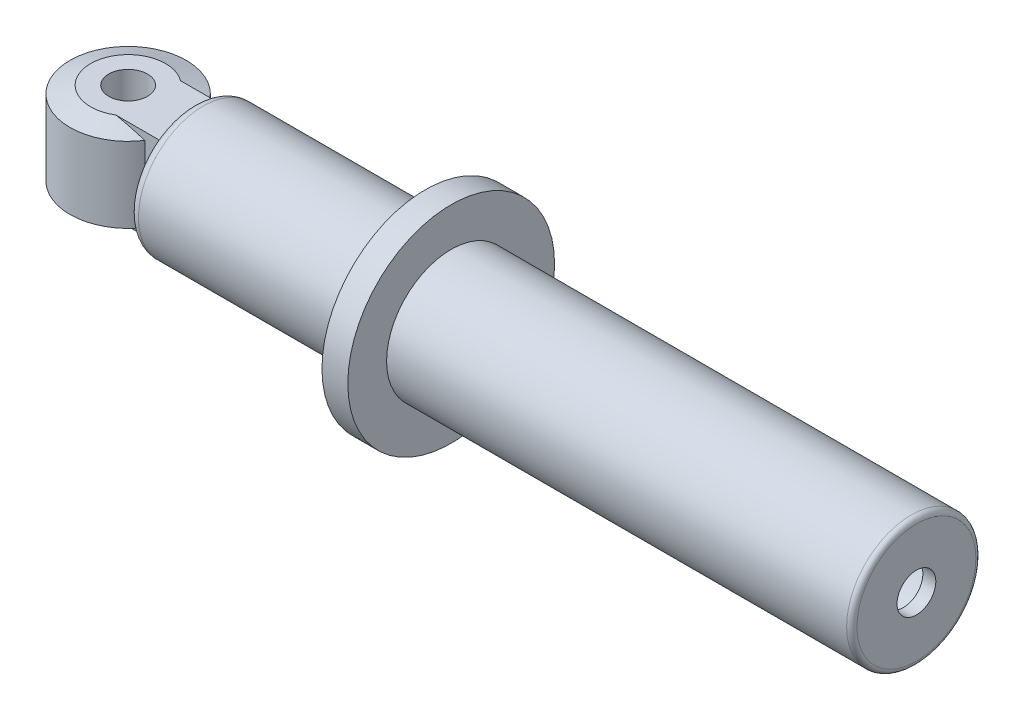
ISO-10303-21;
HEADER;
FILE_DESCRIPTION(('STEP AP214'),'2;1');
FILE_NAME('part.step','',(''),(''),'','','');
FILE_SCHEMA(('AUTOMOTIVE_DESIGN { 1 0 10303 214 1 1 1 1 }'));
ENDSEC;
DATA;
#1=APPLICATION_CONTEXT('core data for automotive mechanical design processes');
#2=APPLICATION_PROTOCOL_DEFINITION('international standard','automotive_design',2000,#1);
#3=PRODUCT_CONTEXT('',#1,'mechanical');
#4=PRODUCT('Part','Part','',(#3));
#5=PRODUCT_RELATED_PRODUCT_CATEGORY('part','',(#4));
#6=PRODUCT_DEFINITION_FORMATION('','',#4);
#7=PRODUCT_DEFINITION_CONTEXT('part definition',#1,'design');
#8=PRODUCT_DEFINITION('design','',#6,#7);
#9=PRODUCT_DEFINITION_SHAPE('','',#8);
#10=(LENGTH_UNIT() NAMED_UNIT(*) SI_UNIT(.MILLI.,.METRE.));
#11=(NAMED_UNIT(*) PLANE_ANGLE_UNIT() SI_UNIT($,.RADIAN.));
#12=(NAMED_UNIT(*) SI_UNIT($,.STERADIAN.) SOLID_ANGLE_UNIT());
#13=UNCERTAINTY_MEASURE_WITH_UNIT(LENGTH_MEASURE(1.E-05),#10,'distance_accuracy_value','');
#14=(GEOMETRIC_REPRESENTATION_CONTEXT(3) GLOBAL_UNCERTAINTY_ASSIGNED_CONTEXT((#13)) GLOBAL_UNIT_ASSIGNED_CONTEXT((#10,
#11,#12)) REPRESENTATION_CONTEXT('',''));
#15=CARTESIAN_POINT('',(0.,0.,0.));
#16=DIRECTION('',(0.,0.,1.));
#17=DIRECTION('',(1.,0.,0.));
#18=AXIS2_PLACEMENT_3D('',#15,#16,#17);
#19=CARTESIAN_POINT('',(-96.1974013589838,0.,-6.88881737924014));
#20=DIRECTION('',(-1.,0.,0.));
#21=DIRECTION('',(0.,0.,1.));
#22=AXIS2_PLACEMENT_3D('',#19,#20,#21);
#23=PLANE('',#22);
#24=DIRECTION('',(0.,-1.,0.));
#25=VECTOR('',#24,1.);
#26=CARTESIAN_POINT('',(-96.1974013589838,11.1125,-9.69286101077848));
#27=LINE('',#26,#25);
#28=CARTESIAN_POINT('',(-96.1974013589838,11.0975940785161,-9.69286101077848));
#29=VERTEX_POINT('',#28);
#30=CARTESIAN_POINT('',(-96.1974013589838,-11.0975940785161,-9.69286101077848));
#31=VERTEX_POINT('',#30);
#32=EDGE_CURVE('E249',#29,#31,#27,.T.);
#33=ORIENTED_EDGE('',*,*,#32,.F.);
#34=CARTESIAN_POINT('',(-96.1974013589838,0.,-2.29924006644521));
#35=DIRECTION('',(-1.,0.,0.));
#36=DIRECTION('',(0.,0.,1.));
#37=AXIS2_PLACEMENT_3D('',#34,#35,#36);
#38=CIRCLE('',#37,13.335);
#39=EDGE_CURVE('E140',#29,#31,#38,.T.);
#40=ORIENTED_EDGE('',*,*,#39,.T.);
#41=EDGE_LOOP('',(#33,#40));
#42=FACE_BOUND('',#41,.T.);
#43=ADVANCED_FACE('F34',(#42),#23,.T.);
#44=DIRECTION('',(0.,0.,-1.));
#45=VECTOR('',#44,1.);
#46=CARTESIAN_POINT('',(-96.1974013589838,-11.1125,-9.69286101077848));
#47=LINE('',#46,#45);
#48=CARTESIAN_POINT('',(-96.1974013589838,-11.1125,5.07195853011967));
#49=VERTEX_POINT('',#48);
#50=CARTESIAN_POINT('',(-96.1974013589838,-11.1125,-9.67043866301009));
#51=VERTEX_POINT('',#50);
#52=EDGE_CURVE('E257',#49,#51,#47,.T.);
#53=ORIENTED_EDGE('',*,*,#52,.T.);
#54=CARTESIAN_POINT('',(-96.1974013589838,0.,-2.29924006644521));
#55=DIRECTION('',(-1.,0.,0.));
#56=DIRECTION('',(0.,0.,1.));
#57=AXIS2_PLACEMENT_3D('',#54,#55,#56);
#58=CIRCLE('',#57,13.335);
#59=EDGE_CURVE('E132',#51,#49,#58,.T.);
#60=ORIENTED_EDGE('',*,*,#59,.T.);
#61=EDGE_LOOP('',(#53,#60));
#62=FACE_BOUND('',#61,.T.);
#63=ADVANCED_FACE('F225',(#62),#23,.T.);
#64=DIRECTION('',(0.,-1.,0.));
#65=VECTOR('',#64,1.);
#66=CARTESIAN_POINT('',(-96.1974013589838,11.1125,5.54713898922151));
#67=LINE('',#66,#65);
#68=CARTESIAN_POINT('',(-96.1974013589838,10.7822335679948,5.54713898922151));
#69=VERTEX_POINT('',#68);
#70=CARTESIAN_POINT('',(-96.1974013589838,-10.7822335679948,5.54713898922151));
#71=VERTEX_POINT('',#70);
#72=EDGE_CURVE('E246',#69,#71,#67,.T.);
#73=ORIENTED_EDGE('',*,*,#72,.T.);
#74=CARTESIAN_POINT('',(-96.1974013589838,0.,-2.29924006644521));
#75=DIRECTION('',(-1.,0.,0.));
#76=DIRECTION('',(0.,0.,1.));
#77=AXIS2_PLACEMENT_3D('',#74,#75,#76);
#78=CIRCLE('',#77,13.335);
#79=EDGE_CURVE('E129',#71,#69,#78,.T.);
#80=ORIENTED_EDGE('',*,*,#79,.T.);
#81=EDGE_LOOP('',(#73,#80));
#82=FACE_BOUND('',#81,.T.);
#83=ADVANCED_FACE('F230',(#82),#23,.T.);
#84=DIRECTION('',(0.,0.,-1.));
#85=VECTOR('',#84,1.);
#86=CARTESIAN_POINT('',(-96.1974013589838,11.1125,-9.69286101077848));
#87=LINE('',#86,#85);
#88=CARTESIAN_POINT('',(-96.1974013589838,11.1125,5.07195853011967));
#89=VERTEX_POINT('',#88);
#90=CARTESIAN_POINT('',(-96.1974013589838,11.1125,-9.67043866301009));
#91=VERTEX_POINT('',#90);
#92=EDGE_CURVE('E115',#89,#91,#87,.T.);
#93=ORIENTED_EDGE('',*,*,#92,.F.);
#94=CARTESIAN_POINT('',(-96.1974013589838,0.,-2.29924006644521));
#95=DIRECTION('',(-1.,0.,0.));
#96=DIRECTION('',(0.,0.,1.));
#97=AXIS2_PLACEMENT_3D('',#94,#95,#96);
#98=CIRCLE('',#97,13.335);
#99=EDGE_CURVE('E125',#89,#91,#98,.T.);
#100=ORIENTED_EDGE('',*,*,#99,.T.);
#101=EDGE_LOOP('',(#93,#100));
#102=FACE_BOUND('',#101,.T.);
#103=ADVANCED_FACE('F124',(#102),#23,.T.);
#104=CARTESIAN_POINT('',(2.22759864101624,0.,-6.88881737924014));
#105=DIRECTION('',(1.,0.,0.));
#106=DIRECTION('',(0.,0.,-1.));
#107=AXIS2_PLACEMENT_3D('',#104,#105,#106);
#108=PLANE('',#107);
#109=CARTESIAN_POINT('',(2.22759864101624,0.,-2.29924006644521));
#110=DIRECTION('',(-1.,0.,0.));
#111=DIRECTION('',(0.,0.,1.));
#112=AXIS2_PLACEMENT_3D('',#109,#110,#111);
#113=CIRCLE('',#112,12.7);
#114=CARTESIAN_POINT('',(2.22759864101624,0.,10.4007599335548));
#115=VERTEX_POINT('',#114);
#116=EDGE_CURVE('E130',#115,#115,#113,.T.);
#117=ORIENTED_EDGE('',*,*,#116,.F.);
#118=EDGE_LOOP('',(#117));
#119=FACE_BOUND('',#118,.T.);
#120=ADVANCED_FACE('F234',(#119),#108,.T.);
#121=CARTESIAN_POINT('',(-96.1974013589838,0.,-2.29924006644521));
#122=DIRECTION('',(-1.,0.,0.));
#123=DIRECTION('',(0.,0.,1.));
#124=AXIS2_PLACEMENT_3D('',#121,#122,#123);
#125=CYLINDRICAL_SURFACE('',#124,12.7);
#126=ORIENTED_EDGE('',*,*,#116,.T.);
#127=EDGE_LOOP('',(#126));
#128=FACE_BOUND('',#127,.T.);
#129=CARTESIAN_POINT('',(78.4275986410162,0.,-2.29924006644521));
#130=DIRECTION('',(-1.,0.,0.));
#131=DIRECTION('',(0.,0.,1.));
#132=AXIS2_PLACEMENT_3D('',#129,#130,#131);
#133=CIRCLE('',#132,12.7);
#134=CARTESIAN_POINT('',(78.4275986410162,0.,10.4007599335548));
#135=VERTEX_POINT('',#134);
#136=EDGE_CURVE('E135',#135,#135,#133,.T.);
#137=ORIENTED_EDGE('',*,*,#136,.F.);
#138=EDGE_LOOP('',(#137));
#139=FACE_BOUND('',#138,.T.);
#140=ADVANCED_FACE('F239',(#128,#139),#125,.F.);
#141=CARTESIAN_POINT('',(78.4275986410162,0.,-6.88881737924014));
#142=DIRECTION('',(-1.,0.,0.));
#143=DIRECTION('',(0.,0.,1.));
#144=AXIS2_PLACEMENT_3D('',#141,#142,#143);
#145=PLANE('',#144);
#146=ORIENTED_EDGE('',*,*,#136,.T.);
#147=EDGE_LOOP('',(#146));
#148=FACE_BOUND('',#147,.T.);
#149=CARTESIAN_POINT('',(78.4275986410163,0.,-2.29924006644521));
#150=DIRECTION('',(-1.,0.,0.));
#151=DIRECTION('',(0.,0.,1.));
#152=AXIS2_PLACEMENT_3D('',#149,#150,#151);
#153=CIRCLE('',#152,4.7625);
#154=CARTESIAN_POINT('',(78.4275986410163,0.,2.46325993355479));
#155=VERTEX_POINT('',#154);
#156=EDGE_CURVE('E290',#155,#155,#153,.T.);
#157=ORIENTED_EDGE('',*,*,#156,.F.);
#158=EDGE_LOOP('',(#157));
#159=FACE_BOUND('',#158,.T.);
#160=ADVANCED_FACE('F295',(#148,#159),#145,.T.);
#161=CARTESIAN_POINT('',(-96.1974013589838,0.,-2.29924006644521));
#162=DIRECTION('',(-1.,0.,0.));
#163=DIRECTION('',(0.,0.,1.));
#164=AXIS2_PLACEMENT_3D('',#161,#162,#163);
#165=CYLINDRICAL_SURFACE('',#164,4.7625);
#166=ORIENTED_EDGE('',*,*,#156,.T.);
#167=EDGE_LOOP('',(#166));
#168=FACE_BOUND('',#167,.T.);
#169=CARTESIAN_POINT('',(81.6025986410162,0.,-2.29924006644521));
#170=DIRECTION('',(-1.,0.,0.));
#171=DIRECTION('',(0.,0.,1.));
#172=AXIS2_PLACEMENT_3D('',#169,#170,#171);
#173=CIRCLE('',#172,4.7625);
#174=CARTESIAN_POINT('',(81.6025986410162,0.,2.46325993355479));
#175=VERTEX_POINT('',#174);
#176=EDGE_CURVE('E287',#175,#175,#173,.T.);
#177=ORIENTED_EDGE('',*,*,#176,.F.);
#178=EDGE_LOOP('',(#177));
#179=FACE_BOUND('',#178,.T.);
#180=ADVANCED_FACE('F304',(#168,#179),#165,.F.);
#181=CARTESIAN_POINT('',(81.6025986410162,0.,-6.88881737924014));
#182=DIRECTION('',(1.,0.,0.));
#183=DIRECTION('',(0.,0.,-1.));
#184=AXIS2_PLACEMENT_3D('',#181,#182,#183);
#185=PLANE('',#184);
#186=CARTESIAN_POINT('',(81.6025986410162,0.,-2.29924006644521));
#187=DIRECTION('',(1.,0.,0.));
#188=DIRECTION('',(0.,0.,-1.));
#189=AXIS2_PLACEMENT_3D('',#186,#187,#188);
#190=CIRCLE('',#189,14.605);
#191=CARTESIAN_POINT('',(81.6025986410162,0.,-16.9042400664452));
#192=VERTEX_POINT('',#191);
#193=EDGE_CURVE('E11',#192,#192,#190,.T.);
#194=ORIENTED_EDGE('',*,*,#193,.T.);
#195=EDGE_LOOP('',(#194));
#196=FACE_BOUND('',#195,.T.);
#197=ORIENTED_EDGE('',*,*,#176,.T.);
#198=EDGE_LOOP('',(#197));
#199=FACE_BOUND('',#198,.T.);
#200=ADVANCED_FACE('F309',(#196,#199),#185,.T.);
#201=CARTESIAN_POINT('',(-96.1974013589838,0.,-2.29924006644521));
#202=DIRECTION('',(-1.,0.,0.));
#203=DIRECTION('',(0.,0.,1.));
#204=AXIS2_PLACEMENT_3D('',#201,#202,#203);
#205=CYLINDRICAL_SURFACE('',#204,15.875);
#206=CARTESIAN_POINT('',(80.3325986410162,0.,-2.29924006644521));
#207=DIRECTION('',(1.,0.,0.));
#208=DIRECTION('',(0.,0.,-1.));
#209=AXIS2_PLACEMENT_3D('',#206,#207,#208);
#210=CIRCLE('',#209,15.875);
#211=CARTESIAN_POINT('',(80.3325986410162,0.,-18.1742400664452));
#212=VERTEX_POINT('',#211);
#213=EDGE_CURVE('E42',#212,#212,#210,.F.);
#214=ORIENTED_EDGE('',*,*,#213,.T.);
#215=EDGE_LOOP('',(#214));
#216=FACE_BOUND('',#215,.T.);
#217=CARTESIAN_POINT('',(-32.6974013589837,0.,-2.29924006644521));
#218=DIRECTION('',(-1.,0.,0.));
#219=DIRECTION('',(0.,0.,1.));
#220=AXIS2_PLACEMENT_3D('',#217,#218,#219);
#221=CIRCLE('',#220,15.875);
#222=CARTESIAN_POINT('',(-32.6974013589837,0.,13.5757599335548));
#223=VERTEX_POINT('',#222);
#224=EDGE_CURVE('E284',#223,#223,#221,.T.);
#225=ORIENTED_EDGE('',*,*,#224,.F.);
#226=EDGE_LOOP('',(#225));
#227=FACE_BOUND('',#226,.T.);
#228=ADVANCED_FACE('F313',(#216,#227),#205,.T.);
#229=CARTESIAN_POINT('',(-32.6974013589837,0.,-6.88881737924005));
#230=DIRECTION('',(1.,0.,0.));
#231=DIRECTION('',(0.,0.,-1.));
#232=AXIS2_PLACEMENT_3D('',#229,#230,#231);
#233=PLANE('',#232);
#234=ORIENTED_EDGE('',*,*,#224,.T.);
#235=EDGE_LOOP('',(#234));
#236=FACE_BOUND('',#235,.T.);
#237=CARTESIAN_POINT('',(-32.6974013589837,0.,-2.29924006644521));
#238=DIRECTION('',(-1.,0.,0.));
#239=DIRECTION('',(0.,0.,1.));
#240=AXIS2_PLACEMENT_3D('',#237,#238,#239);
#241=CIRCLE('',#240,25.4);
#242=CARTESIAN_POINT('',(-32.6974013589837,0.,23.1007599335548));
#243=VERTEX_POINT('',#242);
#244=EDGE_CURVE('E281',#243,#243,#241,.T.);
#245=ORIENTED_EDGE('',*,*,#244,.F.);
#246=EDGE_LOOP('',(#245));
#247=FACE_BOUND('',#246,.T.);
#248=ADVANCED_FACE('F317',(#236,#247),#233,.T.);
#249=CARTESIAN_POINT('',(-96.1974013589838,0.,-2.29924006644521));
#250=DIRECTION('',(-1.,0.,0.));
#251=DIRECTION('',(0.,0.,1.));
#252=AXIS2_PLACEMENT_3D('',#249,#250,#251);
#253=CYLINDRICAL_SURFACE('',#252,25.4);
#254=ORIENTED_EDGE('',*,*,#244,.T.);
#255=EDGE_LOOP('',(#254));
#256=FACE_BOUND('',#255,.T.);
#257=CARTESIAN_POINT('',(-39.0474013589837,0.,-2.29924006644521));
#258=DIRECTION('',(-1.,0.,0.));
#259=DIRECTION('',(0.,0.,1.));
#260=AXIS2_PLACEMENT_3D('',#257,#258,#259);
#261=CIRCLE('',#260,25.4);
#262=CARTESIAN_POINT('',(-39.0474013589837,0.,23.1007599335548));
#263=VERTEX_POINT('',#262);
#264=EDGE_CURVE('E278',#263,#263,#261,.T.);
#265=ORIENTED_EDGE('',*,*,#264,.F.);
#266=EDGE_LOOP('',(#265));
#267=FACE_BOUND('',#266,.T.);
#268=ADVANCED_FACE('F321',(#256,#267),#253,.T.);
#269=CARTESIAN_POINT('',(-39.0474013589837,0.,-6.88881737924014));
#270=DIRECTION('',(-1.,0.,0.));
#271=DIRECTION('',(0.,0.,1.));
#272=AXIS2_PLACEMENT_3D('',#269,#270,#271);
#273=PLANE('',#272);
#274=ORIENTED_EDGE('',*,*,#264,.T.);
#275=EDGE_LOOP('',(#274));
#276=FACE_BOUND('',#275,.T.);
#277=CARTESIAN_POINT('',(-39.0474013589837,0.,-2.29924006644521));
#278=DIRECTION('',(-1.,0.,0.));
#279=DIRECTION('',(0.,0.,1.));
#280=AXIS2_PLACEMENT_3D('',#277,#278,#279);
#281=CIRCLE('',#280,15.875);
#282=CARTESIAN_POINT('',(-39.0474013589837,0.,13.5757599335548));
#283=VERTEX_POINT('',#282);
#284=EDGE_CURVE('E275',#283,#283,#281,.T.);
#285=ORIENTED_EDGE('',*,*,#284,.F.);
#286=EDGE_LOOP('',(#285));
#287=FACE_BOUND('',#286,.T.);
#288=ADVANCED_FACE('F325',(#276,#287),#273,.T.);
#289=CARTESIAN_POINT('',(-96.1974013589838,0.,-2.29924006644521));
#290=DIRECTION('',(-1.,0.,0.));
#291=DIRECTION('',(0.,0.,1.));
#292=AXIS2_PLACEMENT_3D('',#289,#290,#291);
#293=CYLINDRICAL_SURFACE('',#292,15.875);
#294=CARTESIAN_POINT('',(-93.6574013589837,0.,-2.29924006644521));
#295=DIRECTION('',(-1.,0.,0.));
#296=DIRECTION('',(0.,0.,1.));
#297=AXIS2_PLACEMENT_3D('',#294,#295,#296);
#298=CIRCLE('',#297,15.875);
#299=CARTESIAN_POINT('',(-93.6574013589837,0.,13.5757599335548));
#300=VERTEX_POINT('',#299);
#301=EDGE_CURVE('E143',#300,#300,#298,.F.);
#302=ORIENTED_EDGE('',*,*,#301,.T.);
#303=EDGE_LOOP('',(#302));
#304=FACE_BOUND('',#303,.T.);
#305=ORIENTED_EDGE('',*,*,#284,.T.);
#306=EDGE_LOOP('',(#305));
#307=FACE_BOUND('',#306,.T.);
#308=ADVANCED_FACE('F210',(#304,#307),#293,.T.);
#309=CARTESIAN_POINT('',(-112.072401358984,11.1125,-2.29924006644521));
#310=DIRECTION('',(0.,1.,0.));
#311=DIRECTION('',(0.,0.,1.));
#312=AXIS2_PLACEMENT_3D('',#309,#310,#311);
#313=PLANE('',#312);
#314=CARTESIAN_POINT('',(-112.072401358984,11.1125,-2.29924006644521));
#315=DIRECTION('',(0.,1.,0.));
#316=DIRECTION('',(0.,0.,1.));
#317=AXIS2_PLACEMENT_3D('',#314,#315,#316);
#318=CIRCLE('',#317,9.2075);
#319=CARTESIAN_POINT('',(-106.584922376653,11.1125,-9.69286101077848));
#320=VERTEX_POINT('',#319);
#321=CARTESIAN_POINT('',(-107.254477328367,11.1125,5.54713898922152));
#322=VERTEX_POINT('',#321);
#323=EDGE_CURVE('E347',#320,#322,#318,.T.);
#324=ORIENTED_EDGE('',*,*,#323,.T.);
#325=DIRECTION('',(1.,0.,0.));
#326=VECTOR('',#325,1.);
#327=CARTESIAN_POINT('',(-96.1974013589838,11.1125,5.54713898922151));
#328=LINE('',#327,#326);
#329=CARTESIAN_POINT('',(-96.1831774937806,11.1125,5.54713898922151));
#330=VERTEX_POINT('',#329);
#331=EDGE_CURVE('E49',#322,#330,#328,.T.);
#332=ORIENTED_EDGE('',*,*,#331,.T.);
#333=CARTESIAN_POINT('',(-96.1831774937806,11.1125,5.54713898922151));
#334=CARTESIAN_POINT('',(-96.1856019810082,11.1125,5.50758580299217));
#335=CARTESIAN_POINT('',(-96.1877030547722,11.1125,5.46801314510971));
#336=CARTESIAN_POINT('',(-96.1912784948805,11.1125,5.38884875387605));
#337=CARTESIAN_POINT('',(-96.1927530078009,11.1125,5.34925702715785));
#338=CARTESIAN_POINT('',(-96.1950965455518,11.1125,5.27005637735863));
#339=CARTESIAN_POINT('',(-96.195965578598,11.1125,5.23044745451824));
#340=CARTESIAN_POINT('',(-96.1971180096283,11.1125,5.15121176611561));
#341=CARTESIAN_POINT('',(-96.1974012704591,11.1125,5.11158499854708));
#342=CARTESIAN_POINT('',(-96.1974013589838,11.1125,5.07195853011967));
#343=B_SPLINE_CURVE_WITH_KNOTS('',3,(#333,#334,#335,#336,#337,#338,#339,#340,#341,#342),
.UNSPECIFIED.,.F.,.F.,(4,2,2,2,4),(0.,0.118880439180969,0.237733052441402,0.356584052989242,
0.475462878317814),.UNSPECIFIED.);
#344=EDGE_CURVE('E111',#330,#89,#343,.T.);
#345=ORIENTED_EDGE('',*,*,#344,.T.);
#346=ORIENTED_EDGE('',*,*,#92,.T.);
#347=CARTESIAN_POINT('',(-96.1974013589838,11.1125,-9.67043866301009));
#348=CARTESIAN_POINT('',(-96.1974013643173,11.1125,-9.67417572780315));
#349=CARTESIAN_POINT('',(-96.197398841608,11.1125,-9.67791278917947));
#350=CARTESIAN_POINT('',(-96.1973887401037,11.1125,-9.68538690510228));
#351=CARTESIAN_POINT('',(-96.1973811613087,11.1125,-9.68912395964874));
#352=CARTESIAN_POINT('',(-96.1973710544708,11.1125,-9.69286101077848));
#353=B_SPLINE_CURVE_WITH_KNOTS('',3,(#347,#348,#349,#350,#351,#352),.UNSPECIFIED.,.F.,.F.,(4,2,
4),(0.,0.0112111866834286,0.0224223733776529),.UNSPECIFIED.);
#354=CARTESIAN_POINT('',(-96.1973710544708,11.1125,-9.69286101077848));
#355=VERTEX_POINT('',#354);
#356=EDGE_CURVE('E120',#91,#355,#353,.T.);
#357=ORIENTED_EDGE('',*,*,#356,.T.);
#358=DIRECTION('',(-1.,0.,0.));
#359=VECTOR('',#358,1.);
#360=CARTESIAN_POINT('',(-99.8467305969553,11.1125,-9.69286101077848));
#361=LINE('',#360,#359);
#362=EDGE_CURVE('E57',#355,#320,#361,.T.);
#363=ORIENTED_EDGE('',*,*,#362,.T.);
#364=EDGE_LOOP('',(#324,#332,#345,#346,#357,#363));
#365=FACE_BOUND('',#364,.T.);
#366=CARTESIAN_POINT('',(-112.072401358984,11.1125,-2.29924006644521));
#367=DIRECTION('',(0.,1.,0.));
#368=DIRECTION('',(0.,0.,1.));
#369=AXIS2_PLACEMENT_3D('',#366,#367,#368);
#370=CIRCLE('',#369,4.7625);
#371=CARTESIAN_POINT('',(-112.072401358984,11.1125,2.46325993355479));
#372=VERTEX_POINT('',#371);
#373=EDGE_CURVE('E264',#372,#372,#370,.T.);
#374=ORIENTED_EDGE('',*,*,#373,.F.);
#375=EDGE_LOOP('',(#374));
#376=FACE_BOUND('',#375,.T.);
#377=ADVANCED_FACE('F113',(#365,#376),#313,.T.);
#378=CARTESIAN_POINT('',(-112.072401358984,-11.1125,-2.29924006644521));
#379=DIRECTION('',(0.,1.,0.));
#380=DIRECTION('',(0.,0.,1.));
#381=AXIS2_PLACEMENT_3D('',#378,#379,#380);
#382=PLANE('',#381);
#383=DIRECTION('',(1.,0.,0.));
#384=VECTOR('',#383,1.);
#385=CARTESIAN_POINT('',(-96.1974013589838,-11.1125,5.54713898922151));
#386=LINE('',#385,#384);
#387=CARTESIAN_POINT('',(-107.254477328367,-11.1125,5.54713898922152));
#388=VERTEX_POINT('',#387);
#389=CARTESIAN_POINT('',(-96.1831774937806,-11.1125,5.54713898922151));
#390=VERTEX_POINT('',#389);
#391=EDGE_CURVE('E261',#388,#390,#386,.T.);
#392=ORIENTED_EDGE('',*,*,#391,.F.);
#393=CARTESIAN_POINT('',(-112.072401358984,-11.1125,-2.29924006644521));
#394=DIRECTION('',(0.,1.,0.));
#395=DIRECTION('',(0.,0.,1.));
#396=AXIS2_PLACEMENT_3D('',#393,#394,#395);
#397=CIRCLE('',#396,9.20749999999999);
#398=CARTESIAN_POINT('',(-106.584922376653,-11.1125,-9.69286101077848));
#399=VERTEX_POINT('',#398);
#400=EDGE_CURVE('E396',#388,#399,#397,.F.);
#401=ORIENTED_EDGE('',*,*,#400,.T.);
#402=DIRECTION('',(-1.,0.,0.));
#403=VECTOR('',#402,1.);
#404=CARTESIAN_POINT('',(-99.8467305969553,-11.1125,-9.69286101077848));
#405=LINE('',#404,#403);
#406=CARTESIAN_POINT('',(-96.1973710544708,-11.1125,-9.69286101077848));
#407=VERTEX_POINT('',#406);
#408=EDGE_CURVE('E259',#407,#399,#405,.T.);
#409=ORIENTED_EDGE('',*,*,#408,.F.);
#410=CARTESIAN_POINT('',(-96.1973710544708,-11.1125,-9.69286101077848));
#411=CARTESIAN_POINT('',(-96.1973811613087,-11.1125,-9.68912395964874));
#412=CARTESIAN_POINT('',(-96.1973887401037,-11.1125,-9.68538690510228));
#413=CARTESIAN_POINT('',(-96.197398841608,-11.1125,-9.67791278917947));
#414=CARTESIAN_POINT('',(-96.1974013643173,-11.1125,-9.67417572780315));
#415=CARTESIAN_POINT('',(-96.1974013589838,-11.1125,-9.67043866301009));
#416=B_SPLINE_CURVE_WITH_KNOTS('',3,(#410,#411,#412,#413,#414,#415),.UNSPECIFIED.,.F.,.F.,(4,2,
4),(0.,0.0112111866942244,0.0224223733776529),.UNSPECIFIED.);
#417=EDGE_CURVE('E154',#407,#51,#416,.T.);
#418=ORIENTED_EDGE('',*,*,#417,.T.);
#419=ORIENTED_EDGE('',*,*,#52,.F.);
#420=CARTESIAN_POINT('',(-96.1974013589838,-11.1125,5.07195853011967));
#421=CARTESIAN_POINT('',(-96.1974012704591,-11.1125,5.11158499854708));
#422=CARTESIAN_POINT('',(-96.1971180096283,-11.1125,5.15121176611561));
#423=CARTESIAN_POINT('',(-96.195965578598,-11.1125,5.23044745451824));
#424=CARTESIAN_POINT('',(-96.1950965455518,-11.1125,5.27005637735863));
#425=CARTESIAN_POINT('',(-96.1927530078009,-11.1125,5.34925702715785));
#426=CARTESIAN_POINT('',(-96.1912784948805,-11.1125,5.38884875387605));
#427=CARTESIAN_POINT('',(-96.1877030547722,-11.1125,5.46801314510971));
#428=CARTESIAN_POINT('',(-96.1856019810082,-11.1125,5.50758580299217));
#429=CARTESIAN_POINT('',(-96.1831774937806,-11.1125,5.54713898922151));
#430=B_SPLINE_CURVE_WITH_KNOTS('',3,(#420,#421,#422,#423,#424,#425,#426,#427,#428,#429),
.UNSPECIFIED.,.F.,.F.,(4,2,2,2,4),(0.,0.118878825328572,0.237729825876412,0.356582439136845,
0.475462878317814),.UNSPECIFIED.);
#431=EDGE_CURVE('E178',#49,#390,#430,.T.);
#432=ORIENTED_EDGE('',*,*,#431,.T.);
#433=EDGE_LOOP('',(#392,#401,#409,#418,#419,#432));
#434=FACE_BOUND('',#433,.T.);
#435=CARTESIAN_POINT('',(-112.072401358984,-11.1125,-2.29924006644521));
#436=DIRECTION('',(0.,1.,0.));
#437=DIRECTION('',(0.,0.,1.));
#438=AXIS2_PLACEMENT_3D('',#435,#436,#437);
#439=CIRCLE('',#438,4.7625);
#440=CARTESIAN_POINT('',(-112.072401358984,-11.1125,2.46325993355479));
#441=VERTEX_POINT('',#440);
#442=EDGE_CURVE('E401',#441,#441,#439,.T.);
#443=ORIENTED_EDGE('',*,*,#442,.T.);
#444=EDGE_LOOP('',(#443));
#445=FACE_BOUND('',#444,.T.);
#446=ADVANCED_FACE('F209',(#434,#445),#382,.F.);
#447=CARTESIAN_POINT('',(-112.072401358984,11.1125,-2.29924006644521));
#448=DIRECTION('',(0.,-1.,0.));
#449=DIRECTION('',(0.,0.,-1.));
#450=AXIS2_PLACEMENT_3D('',#447,#448,#449);
#451=CYLINDRICAL_SURFACE('',#450,14.2875);
#452=DIRECTION('',(0.,-1.,0.));
#453=VECTOR('',#452,1.);
#454=CARTESIAN_POINT('',(-99.8467305969553,11.1125,-9.69286101077848));
#455=LINE('',#454,#453);
#456=CARTESIAN_POINT('',(-99.8467305969553,9.2635312099277,-9.69286101077848));
#457=VERTEX_POINT('',#456);
#458=CARTESIAN_POINT('',(-99.8467305969553,-9.2635312099277,-9.69286101077848));
#459=VERTEX_POINT('',#458);
#460=EDGE_CURVE('E268',#457,#459,#455,.T.);
#461=ORIENTED_EDGE('',*,*,#460,.T.);
#462=CARTESIAN_POINT('',(-112.072401358984,-9.2635312099277,-2.29924006644521));
#463=DIRECTION('',(0.,1.,0.));
#464=DIRECTION('',(0.,0.,1.));
#465=AXIS2_PLACEMENT_3D('',#462,#463,#464);
#466=CIRCLE('',#465,14.2875);
#467=CARTESIAN_POINT('',(-100.132259317752,-9.2635312099277,5.54713898922152));
#468=VERTEX_POINT('',#467);
#469=EDGE_CURVE('E394',#459,#468,#466,.T.);
#470=ORIENTED_EDGE('',*,*,#469,.T.);
#471=DIRECTION('',(0.,-1.,0.));
#472=VECTOR('',#471,1.);
#473=CARTESIAN_POINT('',(-100.132259317752,11.1125,5.54713898922152));
#474=LINE('',#473,#472);
#475=CARTESIAN_POINT('',(-100.132259317752,9.2635312099277,5.54713898922152));
#476=VERTEX_POINT('',#475);
#477=EDGE_CURVE('E248',#476,#468,#474,.T.);
#478=ORIENTED_EDGE('',*,*,#477,.F.);
#479=CARTESIAN_POINT('',(-112.072401358984,9.2635312099277,-2.29924006644521));
#480=DIRECTION('',(0.,1.,0.));
#481=DIRECTION('',(0.,0.,1.));
#482=AXIS2_PLACEMENT_3D('',#479,#480,#481);
#483=CIRCLE('',#482,14.2875);
#484=EDGE_CURVE('E375',#476,#457,#483,.F.);
#485=ORIENTED_EDGE('',*,*,#484,.T.);
#486=EDGE_LOOP('',(#461,#470,#478,#485));
#487=FACE_BOUND('',#486,.T.);
#488=ADVANCED_FACE('F214',(#487),#451,.T.);
#489=CARTESIAN_POINT('',(-96.1974013589838,11.1125,5.54713898922151));
#490=DIRECTION('',(0.,0.,-1.));
#491=DIRECTION('',(-1.,0.,0.));
#492=AXIS2_PLACEMENT_3D('',#489,#490,#491);
#493=PLANE('',#492);
#494=ORIENTED_EDGE('',*,*,#391,.T.);
#495=CARTESIAN_POINT('',(-96.1831774937806,-11.1125,5.54713898922151));
#496=CARTESIAN_POINT('',(-96.1879314783715,-11.0575581098776,5.54713898922151));
#497=CARTESIAN_POINT('',(-96.1914937927523,-11.0025648971421,5.54713898922151));
#498=CARTESIAN_POINT('',(-96.1962350699155,-10.8924760859897,5.54713898922151));
#499=CARTESIAN_POINT('',(-96.1974140439358,-10.8373804880568,5.54713898922151));
#500=CARTESIAN_POINT('',(-96.1974013589838,-10.7822335679948,5.54713898922151));
#501=B_SPLINE_CURVE_WITH_KNOTS('',3,(#495,#496,#497,#498,#499,#500),.UNSPECIFIED.,.F.,.F.,(4,2,
4),(0.,0.165325411768622,0.330650043998417),.UNSPECIFIED.);
#502=EDGE_CURVE('E184',#390,#71,#501,.T.);
#503=ORIENTED_EDGE('',*,*,#502,.T.);
#504=ORIENTED_EDGE('',*,*,#72,.F.);
#505=CARTESIAN_POINT('',(-96.1974013589838,10.7822335679948,5.54713898922151));
#506=CARTESIAN_POINT('',(-96.1974140439358,10.8373804880568,5.54713898922151));
#507=CARTESIAN_POINT('',(-96.1962350699155,10.8924760859897,5.54713898922151));
#508=CARTESIAN_POINT('',(-96.1914937927523,11.0025648971421,5.54713898922151));
#509=CARTESIAN_POINT('',(-96.1879314783715,11.0575581098776,5.54713898922151));
#510=CARTESIAN_POINT('',(-96.1831774937806,11.1125,5.54713898922151));
#511=B_SPLINE_CURVE_WITH_KNOTS('',3,(#505,#506,#507,#508,#509,#510),.UNSPECIFIED.,.F.,.F.,(4,2,
4),(0.,0.165324632229795,0.330650043998417),.UNSPECIFIED.);
#512=EDGE_CURVE('E121',#69,#330,#511,.T.);
#513=ORIENTED_EDGE('',*,*,#512,.T.);
#514=ORIENTED_EDGE('',*,*,#331,.F.);
#515=CARTESIAN_POINT('',(-107.254477328367,11.1125,5.54713898922152));
#516=CARTESIAN_POINT('',(-106.95294902231,11.0550441399545,5.54713898922152));
#517=CARTESIAN_POINT('',(-106.652156058234,10.9938703188712,5.54713898922152));
#518=CARTESIAN_POINT('',(-106.051967746576,10.8651953655033,5.54713898922152));
#519=CARTESIAN_POINT('',(-105.752572204602,10.7976951425851,5.54713898922152));
#520=CARTESIAN_POINT('',(-105.155214725989,10.6575047633606,5.54713898922152));
#521=CARTESIAN_POINT('',(-104.857251979336,10.5848180326409,5.54713898922152));
#522=CARTESIAN_POINT('',(-104.262413002558,10.4350903835604,5.54713898922152));
#523=CARTESIAN_POINT('',(-103.96553681621,10.3580492917796,5.54713898922152));
#524=CARTESIAN_POINT('',(-103.372878520006,10.2003842071092,5.54713898922152));
#525=CARTESIAN_POINT('',(-103.077095991057,10.1197617845119,5.54713898922152));
#526=CARTESIAN_POINT('',(-102.486374453285,9.95549887821898,5.54713898922152));
#527=CARTESIAN_POINT('',(-102.19143543784,9.87185841828802,5.54713898922152));
#528=CARTESIAN_POINT('',(-101.602089435077,9.70199255027404,5.54713898922152));
#529=CARTESIAN_POINT('',(-101.307682939453,9.61576544026156,5.54713898922152));
#530=CARTESIAN_POINT('',(-100.719513457258,9.44116378723872,5.54713898922152));
#531=CARTESIAN_POINT('',(-100.425750457678,9.35278928808295,5.54713898922152));
#532=CARTESIAN_POINT('',(-100.132259317752,9.2635312099277,5.54713898922152));
#533=B_SPLINE_CURVE_WITH_KNOTS('',3,(#515,#516,#517,#518,#519,#520,#521,#522,#523,#524,#525,
#526,#527,#528,#529,#530,#531,#532),.UNSPECIFIED.,.F.,.F.,(4,2,2,2,2,2,2,2,4),(0.,
0.920799186455728,1.84146621827929,2.76153069794122,3.68163184664906,4.60133346928347,
5.52102785160463,6.44134124126159,7.36163585177927),.UNSPECIFIED.);
#534=EDGE_CURVE('E352',#322,#476,#533,.T.);
#535=ORIENTED_EDGE('',*,*,#534,.T.);
#536=ORIENTED_EDGE('',*,*,#477,.T.);
#537=CARTESIAN_POINT('',(-100.132259317752,-9.2635312099277,5.54713898922152));
#538=CARTESIAN_POINT('',(-100.425750457678,-9.35278928808296,5.54713898922152));
#539=CARTESIAN_POINT('',(-100.719513457258,-9.44116378723872,5.54713898922152));
#540=CARTESIAN_POINT('',(-101.307682939453,-9.61576544026157,5.54713898922152));
#541=CARTESIAN_POINT('',(-101.602089435077,-9.70199255027404,5.54713898922152));
#542=CARTESIAN_POINT('',(-102.19143543784,-9.87185841828802,5.54713898922152));
#543=CARTESIAN_POINT('',(-102.486374453285,-9.95549887821897,5.54713898922152));
#544=CARTESIAN_POINT('',(-103.077095991057,-10.1197617845118,5.54713898922152));
#545=CARTESIAN_POINT('',(-103.372878520006,-10.2003842071092,5.54713898922152));
#546=CARTESIAN_POINT('',(-103.96553681621,-10.3580492917796,5.54713898922152));
#547=CARTESIAN_POINT('',(-104.262413002558,-10.4350903835604,5.54713898922152));
#548=CARTESIAN_POINT('',(-104.857251979336,-10.5848180326409,5.54713898922152));
#549=CARTESIAN_POINT('',(-105.155214725989,-10.6575047633606,5.54713898922152));
#550=CARTESIAN_POINT('',(-105.752572204602,-10.7976951425851,5.54713898922152));
#551=CARTESIAN_POINT('',(-106.051967746576,-10.8651953655033,5.54713898922152));
#552=CARTESIAN_POINT('',(-106.652156058234,-10.9938703188712,5.54713898922152));
#553=CARTESIAN_POINT('',(-106.95294902231,-11.0550441399545,5.54713898922152));
#554=CARTESIAN_POINT('',(-107.254477328367,-11.1125,5.54713898922152));
#555=B_SPLINE_CURVE_WITH_KNOTS('',3,(#537,#538,#539,#540,#541,#542,#543,#544,#545,#546,#547,
#548,#549,#550,#551,#552,#553,#554),.UNSPECIFIED.,.F.,.F.,(4,2,2,2,2,2,2,2,4),(0.,
0.920294610517693,1.84060800017465,2.76030238249579,3.6800040051302,4.60010515383806,
5.52016963349998,6.44083666532354,7.36163585177927),.UNSPECIFIED.);
#556=EDGE_CURVE('E339',#468,#388,#555,.T.);
#557=ORIENTED_EDGE('',*,*,#556,.T.);
#558=EDGE_LOOP('',(#494,#503,#504,#513,#514,#535,#536,#557));
#559=FACE_BOUND('',#558,.T.);
#560=ADVANCED_FACE('F220',(#559),#493,.F.);
#561=CARTESIAN_POINT('',(-99.8467305969553,11.1125,-9.69286101077848));
#562=DIRECTION('',(0.,0.,1.));
#563=DIRECTION('',(1.,0.,0.));
#564=AXIS2_PLACEMENT_3D('',#561,#562,#563);
#565=PLANE('',#564);
#566=ORIENTED_EDGE('',*,*,#408,.T.);
#567=CARTESIAN_POINT('',(-106.584922376653,-11.1125,-9.69286101077848));
#568=CARTESIAN_POINT('',(-106.300184298404,-11.0507058655608,-9.69286101077848));
#569=CARTESIAN_POINT('',(-106.016093918279,-10.9860098912687,-9.69286101077848));
#570=CARTESIAN_POINT('',(-105.449106062802,-10.851693946256,-9.69286101077848));
#571=CARTESIAN_POINT('',(-105.166208474349,-10.7820744540377,-9.69286101077848));
#572=CARTESIAN_POINT('',(-104.601573879199,-10.6388106371861,-9.69286101077848));
#573=CARTESIAN_POINT('',(-104.319836412937,-10.5651681134639,-9.69286101077848));
#574=CARTESIAN_POINT('',(-103.757261958263,-10.4145001177229,-9.69286101077848));
#575=CARTESIAN_POINT('',(-103.476424994428,-10.3374745542016,-9.69286101077848));
#576=CARTESIAN_POINT('',(-102.635258589954,-10.1022455757283,-9.69286101077848));
#577=CARTESIAN_POINT('',(-102.076102167944,-9.93984559286673,-9.69286101077848));
#578=CARTESIAN_POINT('',(-101.239022196491,-9.69029760131159,-9.69286101077848));
#579=CARTESIAN_POINT('',(-100.960207126045,-9.60610347254154,-9.69286101077848));
#580=CARTESIAN_POINT('',(-100.403098236389,-9.43602008431169,-9.69286101077848));
#581=CARTESIAN_POINT('',(-100.124804410316,-9.35013084734078,-9.69286101077848));
#582=CARTESIAN_POINT('',(-99.8467305969553,-9.2635312099277,-9.69286101077848));
#583=B_SPLINE_CURVE_WITH_KNOTS('',3,(#567,#568,#569,#570,#571,#572,#573,#574,#575,#576,#577,
#578,#579,#580,#581,#582),.UNSPECIFIED.,.F.,.F.,(4,2,2,2,2,2,2,4),(0.,0.874058203880869,
1.74803157704728,2.62161687162225,3.49522580902699,5.24191251132868,6.11565947115264,
6.98939484681407),.UNSPECIFIED.);
#584=EDGE_CURVE('E346',#399,#459,#583,.T.);
#585=ORIENTED_EDGE('',*,*,#584,.T.);
#586=ORIENTED_EDGE('',*,*,#460,.F.);
#587=CARTESIAN_POINT('',(-99.8467305969553,9.2635312099277,-9.69286101077848));
#588=CARTESIAN_POINT('',(-100.124804410316,9.35013084734078,-9.69286101077848));
#589=CARTESIAN_POINT('',(-100.403098236389,9.43602008431169,-9.69286101077848));
#590=CARTESIAN_POINT('',(-100.960207126045,9.60610347254154,-9.69286101077848));
#591=CARTESIAN_POINT('',(-101.239022196491,9.69029760131159,-9.69286101077848));
#592=CARTESIAN_POINT('',(-102.076102167944,9.93984559286674,-9.69286101077848));
#593=CARTESIAN_POINT('',(-102.635258589954,10.1022455757283,-9.69286101077848));
#594=CARTESIAN_POINT('',(-103.476424994428,10.3374745542016,-9.69286101077848));
#595=CARTESIAN_POINT('',(-103.757261958263,10.4145001177229,-9.69286101077848));
#596=CARTESIAN_POINT('',(-104.319836412937,10.5651681134639,-9.69286101077848));
#597=CARTESIAN_POINT('',(-104.601573879199,10.6388106371861,-9.69286101077848));
#598=CARTESIAN_POINT('',(-105.166208474349,10.7820744540377,-9.69286101077848));
#599=CARTESIAN_POINT('',(-105.449106062802,10.851693946256,-9.69286101077848));
#600=CARTESIAN_POINT('',(-106.016093918279,10.9860098912687,-9.69286101077848));
#601=CARTESIAN_POINT('',(-106.300184298404,11.0507058655608,-9.69286101077848));
#602=CARTESIAN_POINT('',(-106.584922376654,11.1125,-9.69286101077848));
#603=B_SPLINE_CURVE_WITH_KNOTS('',3,(#587,#588,#589,#590,#591,#592,#593,#594,#595,#596,#597,
#598,#599,#600,#601,#602),.UNSPECIFIED.,.F.,.F.,(4,2,2,2,2,2,2,4),(0.,0.873735375661431,
1.7474823354854,3.49416903778709,4.36777797519182,5.24136326976681,6.1153366429332,
6.98939484681409),.UNSPECIFIED.);
#604=EDGE_CURVE('E357',#457,#320,#603,.T.);
#605=ORIENTED_EDGE('',*,*,#604,.T.);
#606=ORIENTED_EDGE('',*,*,#362,.F.);
#607=CARTESIAN_POINT('',(-96.1973710544708,11.1125,-9.69286101077848));
#608=CARTESIAN_POINT('',(-96.1973811570179,11.1100156900227,-9.69286101077848));
#609=CARTESIAN_POINT('',(-96.1973887336675,11.1075313749102,-9.69286101077848));
#610=CARTESIAN_POINT('',(-96.1973988351718,11.1025627344155,-9.69286101077848));
#611=CARTESIAN_POINT('',(-96.1974013600265,11.1000784090335,-9.69286101077848));
#612=CARTESIAN_POINT('',(-96.1974013589838,11.0975940785161,-9.69286101077848));
#613=B_SPLINE_CURVE_WITH_KNOTS('',3,(#607,#608,#609,#610,#611,#612),.UNSPECIFIED.,.F.,.F.,(4,2,
4),(0.,0.00745297999842926,0.0149059599936841),.UNSPECIFIED.);
#614=EDGE_CURVE('E201',#355,#29,#613,.T.);
#615=ORIENTED_EDGE('',*,*,#614,.T.);
#616=ORIENTED_EDGE('',*,*,#32,.T.);
#617=CARTESIAN_POINT('',(-96.1974013589838,-11.0975940785161,-9.69286101077848));
#618=CARTESIAN_POINT('',(-96.1974013600265,-11.1000784090335,-9.69286101077848));
#619=CARTESIAN_POINT('',(-96.1973988351718,-11.1025627344155,-9.69286101077848));
#620=CARTESIAN_POINT('',(-96.1973887336675,-11.1075313749102,-9.69286101077848));
#621=CARTESIAN_POINT('',(-96.1973811570179,-11.1100156900227,-9.69286101077848));
#622=CARTESIAN_POINT('',(-96.1973710544708,-11.1125,-9.69286101077848));
#623=B_SPLINE_CURVE_WITH_KNOTS('',3,(#617,#618,#619,#620,#621,#622),.UNSPECIFIED.,.F.,.F.,(4,2,
4),(0.,0.00745297999525482,0.0149059599936841),.UNSPECIFIED.);
#624=EDGE_CURVE('E146',#31,#407,#623,.T.);
#625=ORIENTED_EDGE('',*,*,#624,.T.);
#626=EDGE_LOOP('',(#566,#585,#586,#605,#606,#615,#616,#625));
#627=FACE_BOUND('',#626,.T.);
#628=ADVANCED_FACE('F160',(#627),#565,.F.);
#629=CARTESIAN_POINT('',(-112.072401358984,11.1125,-2.29924006644521));
#630=DIRECTION('',(0.,-1.,0.));
#631=DIRECTION('',(0.,0.,-1.));
#632=AXIS2_PLACEMENT_3D('',#629,#630,#631);
#633=CYLINDRICAL_SURFACE('',#632,4.7625);
#634=ORIENTED_EDGE('',*,*,#373,.T.);
#635=EDGE_LOOP('',(#634));
#636=FACE_BOUND('',#635,.T.);
#637=ORIENTED_EDGE('',*,*,#442,.F.);
#638=EDGE_LOOP('',(#637));
#639=FACE_BOUND('',#638,.T.);
#640=ADVANCED_FACE('F168',(#636,#639),#633,.F.);
#641=CARTESIAN_POINT('',(-93.6574013589837,0.,-2.29924006644521));
#642=DIRECTION('',(-1.,0.,0.));
#643=DIRECTION('',(0.,0.,1.));
#644=AXIS2_PLACEMENT_3D('',#641,#642,#643);
#645=TOROIDAL_SURFACE('',#644,13.335,2.54);
#646=ORIENTED_EDGE('',*,*,#301,.F.);
#647=EDGE_LOOP('',(#646));
#648=FACE_BOUND('',#647,.T.);
#649=ORIENTED_EDGE('',*,*,#624,.F.);
#650=ORIENTED_EDGE('',*,*,#39,.F.);
#651=ORIENTED_EDGE('',*,*,#614,.F.);
#652=ORIENTED_EDGE('',*,*,#356,.F.);
#653=ORIENTED_EDGE('',*,*,#99,.F.);
#654=ORIENTED_EDGE('',*,*,#344,.F.);
#655=ORIENTED_EDGE('',*,*,#512,.F.);
#656=ORIENTED_EDGE('',*,*,#79,.F.);
#657=ORIENTED_EDGE('',*,*,#502,.F.);
#658=ORIENTED_EDGE('',*,*,#431,.F.);
#659=ORIENTED_EDGE('',*,*,#59,.F.);
#660=ORIENTED_EDGE('',*,*,#417,.F.);
#661=EDGE_LOOP('',(#649,#650,#651,#652,#653,#654,#655,#656,#657,#658,#659,#660));
#662=FACE_BOUND('',#661,.T.);
#663=ADVANCED_FACE('F127',(#648,#662),#645,.T.);
#664=CARTESIAN_POINT('',(-112.072401358984,-9.2635312099277,-2.29924006644521));
#665=DIRECTION('',(0.,1.,0.));
#666=DIRECTION('',(0.,0.,1.));
#667=AXIS2_PLACEMENT_3D('',#664,#665,#666);
#668=CONICAL_SURFACE('',#667,14.2875,1.22173047639603);
#669=ORIENTED_EDGE('',*,*,#584,.F.);
#670=ORIENTED_EDGE('',*,*,#400,.F.);
#671=ORIENTED_EDGE('',*,*,#556,.F.);
#672=ORIENTED_EDGE('',*,*,#469,.F.);
#673=EDGE_LOOP('',(#669,#670,#671,#672));
#674=FACE_BOUND('',#673,.T.);
#675=ADVANCED_FACE('F167',(#674),#668,.T.);
#676=CARTESIAN_POINT('',(-112.072401358984,11.1125,-2.29924006644521));
#677=DIRECTION('',(0.,-1.,0.));
#678=DIRECTION('',(0.,0.,-1.));
#679=AXIS2_PLACEMENT_3D('',#676,#677,#678);
#680=CONICAL_SURFACE('',#679,9.20749999999999,1.22173047639603);
#681=ORIENTED_EDGE('',*,*,#604,.F.);
#682=ORIENTED_EDGE('',*,*,#484,.F.);
#683=ORIENTED_EDGE('',*,*,#534,.F.);
#684=ORIENTED_EDGE('',*,*,#323,.F.);
#685=EDGE_LOOP('',(#681,#682,#683,#684));
#686=FACE_BOUND('',#685,.T.);
#687=ADVANCED_FACE('F361',(#686),#680,.T.);
#688=CARTESIAN_POINT('',(80.3325986410162,0.,-2.29924006644521));
#689=DIRECTION('',(1.,0.,0.));
#690=DIRECTION('',(0.,0.,-1.));
#691=AXIS2_PLACEMENT_3D('',#688,#689,#690);
#692=TOROIDAL_SURFACE('',#691,14.605,1.27);
#693=ORIENTED_EDGE('',*,*,#193,.F.);
#694=EDGE_LOOP('',(#693));
#695=FACE_BOUND('',#694,.T.);
#696=ORIENTED_EDGE('',*,*,#213,.F.);
#697=EDGE_LOOP('',(#696));
#698=FACE_BOUND('',#697,.T.);
#699=ADVANCED_FACE('F36',(#695,#698),#692,.T.);
#700=CLOSED_SHELL('',(#43,#63,#83,#103,#120,#140,#160,#180,#200,#228,#248,#268,#288,#308,#377,
#446,#488,#560,#628,#640,#663,#675,#687,#699));
#701=MANIFOLD_SOLID_BREP('B2',#700);
#702=ADVANCED_BREP_SHAPE_REPRESENTATION('',(#18,#701),#14);
#703=SHAPE_DEFINITION_REPRESENTATION(#9,#702);
ENDSEC;
END-ISO-10303-21;
